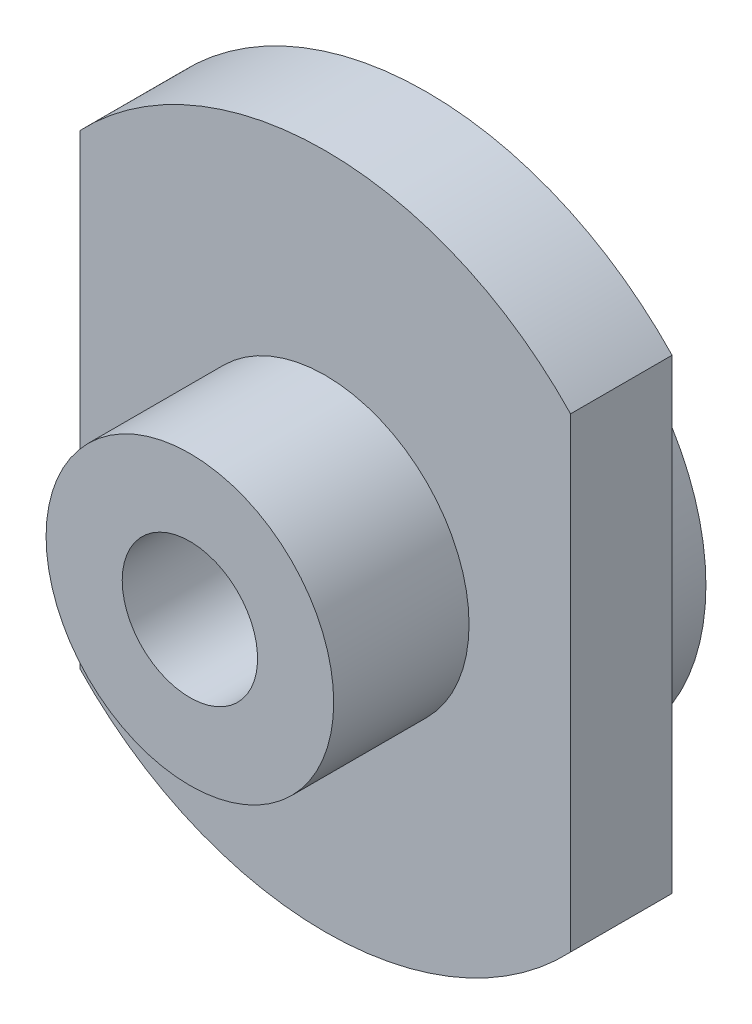
ISO-10303-21;
HEADER;
FILE_DESCRIPTION(('STEP AP214'),'2;1');
FILE_NAME('part.step','',(''),(''),'','','');
FILE_SCHEMA(('AUTOMOTIVE_DESIGN { 1 0 10303 214 1 1 1 1 }'));
ENDSEC;
DATA;
#1=APPLICATION_CONTEXT('core data for automotive mechanical design processes');
#2=APPLICATION_PROTOCOL_DEFINITION('international standard','automotive_design',2000,#1);
#3=PRODUCT_CONTEXT('',#1,'mechanical');
#4=PRODUCT('Part','Part','',(#3));
#5=PRODUCT_RELATED_PRODUCT_CATEGORY('part','',(#4));
#6=PRODUCT_DEFINITION_FORMATION('','',#4);
#7=PRODUCT_DEFINITION_CONTEXT('part definition',#1,'design');
#8=PRODUCT_DEFINITION('design','',#6,#7);
#9=PRODUCT_DEFINITION_SHAPE('','',#8);
#10=(LENGTH_UNIT() NAMED_UNIT(*) SI_UNIT(.MILLI.,.METRE.));
#11=(NAMED_UNIT(*) PLANE_ANGLE_UNIT() SI_UNIT($,.RADIAN.));
#12=(NAMED_UNIT(*) SI_UNIT($,.STERADIAN.) SOLID_ANGLE_UNIT());
#13=UNCERTAINTY_MEASURE_WITH_UNIT(LENGTH_MEASURE(1.E-05),#10,'distance_accuracy_value','');
#14=(GEOMETRIC_REPRESENTATION_CONTEXT(3) GLOBAL_UNCERTAINTY_ASSIGNED_CONTEXT((#13)) GLOBAL_UNIT_ASSIGNED_CONTEXT((#10,
#11,#12)) REPRESENTATION_CONTEXT('',''));
#15=CARTESIAN_POINT('',(0.,0.,0.));
#16=DIRECTION('',(0.,0.,1.));
#17=DIRECTION('',(1.,0.,0.));
#18=AXIS2_PLACEMENT_3D('',#15,#16,#17);
#19=CARTESIAN_POINT('',(0.,0.,149.137084989848));
#20=DIRECTION('',(0.,0.,-1.));
#21=DIRECTION('',(-1.,0.,0.));
#22=AXIS2_PLACEMENT_3D('',#19,#20,#21);
#23=CYLINDRICAL_SURFACE('',#22,40.);
#24=DIRECTION('',(0.,0.,-1.));
#25=VECTOR('',#24,1.);
#26=CARTESIAN_POINT('',(29.,-27.5499546279118,149.137084989848));
#27=LINE('',#26,#25);
#28=CARTESIAN_POINT('',(29.,-27.5499546279118,18.));
#29=VERTEX_POINT('',#28);
#30=CARTESIAN_POINT('',(29.,-27.5499546279118,6.00000000000001));
#31=VERTEX_POINT('',#30);
#32=EDGE_CURVE('E87',#29,#31,#27,.T.);
#33=ORIENTED_EDGE('',*,*,#32,.F.);
#34=CARTESIAN_POINT('',(0.,0.,18.));
#35=DIRECTION('',(0.,0.,1.));
#36=DIRECTION('',(1.,0.,0.));
#37=AXIS2_PLACEMENT_3D('',#34,#35,#36);
#38=CIRCLE('',#37,40.);
#39=CARTESIAN_POINT('',(-29.,-27.5499546279118,18.));
#40=VERTEX_POINT('',#39);
#41=EDGE_CURVE('E77',#40,#29,#38,.T.);
#42=ORIENTED_EDGE('',*,*,#41,.F.);
#43=DIRECTION('',(0.,0.,-1.));
#44=VECTOR('',#43,1.);
#45=CARTESIAN_POINT('',(-29.,-27.5499546279118,149.137084989848));
#46=LINE('',#45,#44);
#47=CARTESIAN_POINT('',(-29.,-27.5499546279118,6.00000000000001));
#48=VERTEX_POINT('',#47);
#49=EDGE_CURVE('E51',#48,#40,#46,.F.);
#50=ORIENTED_EDGE('',*,*,#49,.F.);
#51=CARTESIAN_POINT('',(0.,0.,6.));
#52=DIRECTION('',(0.,0.,1.));
#53=DIRECTION('',(1.,0.,0.));
#54=AXIS2_PLACEMENT_3D('',#51,#52,#53);
#55=CIRCLE('',#54,40.);
#56=EDGE_CURVE('E91',#48,#31,#55,.T.);
#57=ORIENTED_EDGE('',*,*,#56,.T.);
#58=EDGE_LOOP('',(#33,#42,#50,#57));
#59=FACE_BOUND('',#58,.T.);
#60=ADVANCED_FACE('F36',(#59),#23,.T.);
#61=DIRECTION('',(0.,0.,-1.));
#62=VECTOR('',#61,1.);
#63=CARTESIAN_POINT('',(29.,27.5499546279118,149.137084989848));
#64=LINE('',#63,#62);
#65=CARTESIAN_POINT('',(29.,27.5499546279118,6.00000000000001));
#66=VERTEX_POINT('',#65);
#67=CARTESIAN_POINT('',(29.,27.5499546279118,18.));
#68=VERTEX_POINT('',#67);
#69=EDGE_CURVE('E58',#66,#68,#64,.F.);
#70=ORIENTED_EDGE('',*,*,#69,.F.);
#71=CARTESIAN_POINT('',(-29.,27.5499546279118,6.00000000000001));
#72=VERTEX_POINT('',#71);
#73=EDGE_CURVE('E83',#66,#72,#55,.T.);
#74=ORIENTED_EDGE('',*,*,#73,.T.);
#75=DIRECTION('',(0.,0.,-1.));
#76=VECTOR('',#75,1.);
#77=CARTESIAN_POINT('',(-29.,27.5499546279118,149.137084989848));
#78=LINE('',#77,#76);
#79=CARTESIAN_POINT('',(-29.,27.5499546279118,18.));
#80=VERTEX_POINT('',#79);
#81=EDGE_CURVE('E100',#80,#72,#78,.T.);
#82=ORIENTED_EDGE('',*,*,#81,.F.);
#83=EDGE_CURVE('E82',#68,#80,#38,.T.);
#84=ORIENTED_EDGE('',*,*,#83,.F.);
#85=EDGE_LOOP('',(#70,#74,#82,#84));
#86=FACE_BOUND('',#85,.T.);
#87=ADVANCED_FACE('F135',(#86),#23,.T.);
#88=CARTESIAN_POINT('',(0.,0.,6.));
#89=DIRECTION('',(0.,0.,1.));
#90=DIRECTION('',(1.,0.,0.));
#91=AXIS2_PLACEMENT_3D('',#88,#89,#90);
#92=PLANE('',#91);
#93=CARTESIAN_POINT('',(0.,0.,6.00000000000001));
#94=DIRECTION('',(0.,0.,1.));
#95=DIRECTION('',(1.,0.,0.));
#96=AXIS2_PLACEMENT_3D('',#93,#94,#95);
#97=CIRCLE('',#96,27.);
#98=CARTESIAN_POINT('',(27.,0.,6.00000000000001));
#99=VERTEX_POINT('',#98);
#100=EDGE_CURVE('E89',#99,#99,#97,.F.);
#101=ORIENTED_EDGE('',*,*,#100,.F.);
#102=EDGE_LOOP('',(#101));
#103=FACE_BOUND('',#102,.T.);
#104=DIRECTION('',(0.,-1.,0.));
#105=VECTOR('',#104,1.);
#106=CARTESIAN_POINT('',(-29.,0.,6.));
#107=LINE('',#106,#105);
#108=EDGE_CURVE('E103',#72,#48,#107,.T.);
#109=ORIENTED_EDGE('',*,*,#108,.F.);
#110=ORIENTED_EDGE('',*,*,#73,.F.);
#111=DIRECTION('',(0.,1.,0.));
#112=VECTOR('',#111,1.);
#113=CARTESIAN_POINT('',(29.,0.,6.));
#114=LINE('',#113,#112);
#115=EDGE_CURVE('E92',#31,#66,#114,.T.);
#116=ORIENTED_EDGE('',*,*,#115,.F.);
#117=ORIENTED_EDGE('',*,*,#56,.F.);
#118=EDGE_LOOP('',(#109,#110,#116,#117));
#119=FACE_BOUND('',#118,.T.);
#120=ADVANCED_FACE('F132',(#103,#119),#92,.F.);
#121=CARTESIAN_POINT('',(0.,0.,18.));
#122=DIRECTION('',(0.,0.,1.));
#123=DIRECTION('',(1.,0.,0.));
#124=AXIS2_PLACEMENT_3D('',#121,#122,#123);
#125=PLANE('',#124);
#126=CARTESIAN_POINT('',(0.,0.,18.));
#127=DIRECTION('',(0.,0.,1.));
#128=DIRECTION('',(1.,0.,0.));
#129=AXIS2_PLACEMENT_3D('',#126,#127,#128);
#130=CIRCLE('',#129,17.);
#131=CARTESIAN_POINT('',(17.,0.,18.));
#132=VERTEX_POINT('',#131);
#133=EDGE_CURVE('E121',#132,#132,#130,.T.);
#134=ORIENTED_EDGE('',*,*,#133,.F.);
#135=EDGE_LOOP('',(#134));
#136=FACE_BOUND('',#135,.T.);
#137=ORIENTED_EDGE('',*,*,#83,.T.);
#138=DIRECTION('',(0.,-1.,0.));
#139=VECTOR('',#138,1.);
#140=CARTESIAN_POINT('',(-29.,0.,18.));
#141=LINE('',#140,#139);
#142=EDGE_CURVE('E13',#80,#40,#141,.T.);
#143=ORIENTED_EDGE('',*,*,#142,.T.);
#144=ORIENTED_EDGE('',*,*,#41,.T.);
#145=DIRECTION('',(0.,1.,0.));
#146=VECTOR('',#145,1.);
#147=CARTESIAN_POINT('',(29.,0.,18.));
#148=LINE('',#147,#146);
#149=EDGE_CURVE('E44',#29,#68,#148,.T.);
#150=ORIENTED_EDGE('',*,*,#149,.T.);
#151=EDGE_LOOP('',(#137,#143,#144,#150));
#152=FACE_BOUND('',#151,.T.);
#153=ADVANCED_FACE('F78',(#136,#152),#125,.T.);
#154=CARTESIAN_POINT('',(0.,0.,34.));
#155=DIRECTION('',(0.,0.,1.));
#156=DIRECTION('',(1.,0.,0.));
#157=AXIS2_PLACEMENT_3D('',#154,#155,#156);
#158=PLANE('',#157);
#159=CARTESIAN_POINT('',(0.,0.,34.));
#160=DIRECTION('',(0.,0.,-1.));
#161=DIRECTION('',(-1.,0.,0.));
#162=AXIS2_PLACEMENT_3D('',#159,#160,#161);
#163=CIRCLE('',#162,8.);
#164=CARTESIAN_POINT('',(-8.,0.,34.));
#165=VERTEX_POINT('',#164);
#166=EDGE_CURVE('E95',#165,#165,#163,.T.);
#167=ORIENTED_EDGE('',*,*,#166,.T.);
#168=EDGE_LOOP('',(#167));
#169=FACE_BOUND('',#168,.T.);
#170=CARTESIAN_POINT('',(0.,0.,34.));
#171=DIRECTION('',(0.,0.,1.));
#172=DIRECTION('',(1.,0.,0.));
#173=AXIS2_PLACEMENT_3D('',#170,#171,#172);
#174=CIRCLE('',#173,17.);
#175=CARTESIAN_POINT('',(17.,0.,34.));
#176=VERTEX_POINT('',#175);
#177=EDGE_CURVE('E122',#176,#176,#174,.T.);
#178=ORIENTED_EDGE('',*,*,#177,.T.);
#179=EDGE_LOOP('',(#178));
#180=FACE_BOUND('',#179,.T.);
#181=ADVANCED_FACE('F151',(#169,#180),#158,.T.);
#182=CARTESIAN_POINT('',(0.,0.,34.));
#183=DIRECTION('',(0.,0.,-1.));
#184=DIRECTION('',(-1.,0.,0.));
#185=AXIS2_PLACEMENT_3D('',#182,#183,#184);
#186=CYLINDRICAL_SURFACE('',#185,17.);
#187=ORIENTED_EDGE('',*,*,#133,.T.);
#188=EDGE_LOOP('',(#187));
#189=FACE_BOUND('',#188,.T.);
#190=ORIENTED_EDGE('',*,*,#177,.F.);
#191=EDGE_LOOP('',(#190));
#192=FACE_BOUND('',#191,.T.);
#193=ADVANCED_FACE('F38',(#189,#192),#186,.T.);
#194=CARTESIAN_POINT('',(0.,0.,-76.3675323681471));
#195=DIRECTION('',(0.,0.,1.));
#196=DIRECTION('',(1.,0.,0.));
#197=AXIS2_PLACEMENT_3D('',#194,#195,#196);
#198=CYLINDRICAL_SURFACE('',#197,27.);
#199=CARTESIAN_POINT('',(0.,0.,0.));
#200=DIRECTION('',(0.,0.,1.));
#201=DIRECTION('',(1.,0.,0.));
#202=AXIS2_PLACEMENT_3D('',#199,#200,#201);
#203=CIRCLE('',#202,27.);
#204=CARTESIAN_POINT('',(27.,0.,0.));
#205=VERTEX_POINT('',#204);
#206=EDGE_CURVE('E115',#205,#205,#203,.T.);
#207=ORIENTED_EDGE('',*,*,#206,.T.);
#208=EDGE_LOOP('',(#207));
#209=FACE_BOUND('',#208,.T.);
#210=ORIENTED_EDGE('',*,*,#100,.T.);
#211=EDGE_LOOP('',(#210));
#212=FACE_BOUND('',#211,.T.);
#213=ADVANCED_FACE('F130',(#209,#212),#198,.T.);
#214=CARTESIAN_POINT('',(0.,0.,0.));
#215=DIRECTION('',(0.,0.,1.));
#216=DIRECTION('',(1.,0.,0.));
#217=AXIS2_PLACEMENT_3D('',#214,#215,#216);
#218=PLANE('',#217);
#219=CARTESIAN_POINT('',(0.,0.,0.));
#220=DIRECTION('',(0.,0.,-1.));
#221=DIRECTION('',(-1.,0.,0.));
#222=AXIS2_PLACEMENT_3D('',#219,#220,#221);
#223=CIRCLE('',#222,24.);
#224=CARTESIAN_POINT('',(-24.,0.,0.));
#225=VERTEX_POINT('',#224);
#226=EDGE_CURVE('E109',#225,#225,#223,.T.);
#227=ORIENTED_EDGE('',*,*,#226,.F.);
#228=EDGE_LOOP('',(#227));
#229=FACE_BOUND('',#228,.T.);
#230=ORIENTED_EDGE('',*,*,#206,.F.);
#231=EDGE_LOOP('',(#230));
#232=FACE_BOUND('',#231,.T.);
#233=ADVANCED_FACE('F155',(#229,#232),#218,.F.);
#234=CARTESIAN_POINT('',(0.,0.,9.));
#235=DIRECTION('',(0.,0.,-1.));
#236=DIRECTION('',(-1.,0.,0.));
#237=AXIS2_PLACEMENT_3D('',#234,#235,#236);
#238=CYLINDRICAL_SURFACE('',#237,24.);
#239=CARTESIAN_POINT('',(0.,0.,9.));
#240=DIRECTION('',(0.,0.,-1.));
#241=DIRECTION('',(-1.,0.,0.));
#242=AXIS2_PLACEMENT_3D('',#239,#240,#241);
#243=CIRCLE('',#242,24.);
#244=CARTESIAN_POINT('',(-24.,0.,9.));
#245=VERTEX_POINT('',#244);
#246=EDGE_CURVE('E112',#245,#245,#243,.T.);
#247=ORIENTED_EDGE('',*,*,#246,.F.);
#248=EDGE_LOOP('',(#247));
#249=FACE_BOUND('',#248,.T.);
#250=ORIENTED_EDGE('',*,*,#226,.T.);
#251=EDGE_LOOP('',(#250));
#252=FACE_BOUND('',#251,.T.);
#253=ADVANCED_FACE('F157',(#249,#252),#238,.F.);
#254=CARTESIAN_POINT('',(0.,0.,9.));
#255=DIRECTION('',(0.,0.,-1.));
#256=DIRECTION('',(-1.,0.,0.));
#257=AXIS2_PLACEMENT_3D('',#254,#255,#256);
#258=PLANE('',#257);
#259=CARTESIAN_POINT('',(0.,0.,9.));
#260=DIRECTION('',(0.,0.,-1.));
#261=DIRECTION('',(-1.,0.,0.));
#262=AXIS2_PLACEMENT_3D('',#259,#260,#261);
#263=CIRCLE('',#262,12.);
#264=CARTESIAN_POINT('',(-12.,0.,9.));
#265=VERTEX_POINT('',#264);
#266=EDGE_CURVE('E106',#265,#265,#263,.T.);
#267=ORIENTED_EDGE('',*,*,#266,.F.);
#268=EDGE_LOOP('',(#267));
#269=FACE_BOUND('',#268,.T.);
#270=ORIENTED_EDGE('',*,*,#246,.T.);
#271=EDGE_LOOP('',(#270));
#272=FACE_BOUND('',#271,.T.);
#273=ADVANCED_FACE('F164',(#269,#272),#258,.T.);
#274=CARTESIAN_POINT('',(0.,0.,9.));
#275=DIRECTION('',(0.,0.,-1.));
#276=DIRECTION('',(-1.,0.,0.));
#277=AXIS2_PLACEMENT_3D('',#274,#275,#276);
#278=CYLINDRICAL_SURFACE('',#277,12.);
#279=ORIENTED_EDGE('',*,*,#266,.T.);
#280=EDGE_LOOP('',(#279));
#281=FACE_BOUND('',#280,.T.);
#282=CARTESIAN_POINT('',(0.,0.,0.));
#283=DIRECTION('',(0.,0.,-1.));
#284=DIRECTION('',(-1.,0.,0.));
#285=AXIS2_PLACEMENT_3D('',#282,#283,#284);
#286=CIRCLE('',#285,12.);
#287=CARTESIAN_POINT('',(-12.,0.,0.));
#288=VERTEX_POINT('',#287);
#289=EDGE_CURVE('E105',#288,#288,#286,.T.);
#290=ORIENTED_EDGE('',*,*,#289,.F.);
#291=EDGE_LOOP('',(#290));
#292=FACE_BOUND('',#291,.T.);
#293=ADVANCED_FACE('F172',(#281,#292),#278,.T.);
#294=CARTESIAN_POINT('',(0.,0.,0.));
#295=DIRECTION('',(0.,0.,-1.));
#296=DIRECTION('',(-1.,0.,0.));
#297=AXIS2_PLACEMENT_3D('',#294,#295,#296);
#298=CIRCLE('',#297,8.);
#299=CARTESIAN_POINT('',(-8.,0.,0.));
#300=VERTEX_POINT('',#299);
#301=EDGE_CURVE('E185',#300,#300,#298,.T.);
#302=ORIENTED_EDGE('',*,*,#301,.F.);
#303=EDGE_LOOP('',(#302));
#304=FACE_BOUND('',#303,.T.);
#305=ORIENTED_EDGE('',*,*,#289,.T.);
#306=EDGE_LOOP('',(#305));
#307=FACE_BOUND('',#306,.T.);
#308=ADVANCED_FACE('F159',(#304,#307),#218,.F.);
#309=CARTESIAN_POINT('',(0.,0.,34.));
#310=DIRECTION('',(0.,0.,-1.));
#311=DIRECTION('',(-1.,0.,0.));
#312=AXIS2_PLACEMENT_3D('',#309,#310,#311);
#313=CYLINDRICAL_SURFACE('',#312,8.);
#314=ORIENTED_EDGE('',*,*,#166,.F.);
#315=EDGE_LOOP('',(#314));
#316=FACE_BOUND('',#315,.T.);
#317=ORIENTED_EDGE('',*,*,#301,.T.);
#318=EDGE_LOOP('',(#317));
#319=FACE_BOUND('',#318,.T.);
#320=ADVANCED_FACE('F171',(#316,#319),#313,.F.);
#321=CARTESIAN_POINT('',(29.,-40.,34.));
#322=DIRECTION('',(1.,0.,0.));
#323=DIRECTION('',(0.,0.,-1.));
#324=AXIS2_PLACEMENT_3D('',#321,#322,#323);
#325=PLANE('',#324);
#326=ORIENTED_EDGE('',*,*,#115,.T.);
#327=ORIENTED_EDGE('',*,*,#69,.T.);
#328=ORIENTED_EDGE('',*,*,#149,.F.);
#329=ORIENTED_EDGE('',*,*,#32,.T.);
#330=EDGE_LOOP('',(#326,#327,#328,#329));
#331=FACE_BOUND('',#330,.T.);
#332=ADVANCED_FACE('F86',(#331),#325,.T.);
#333=CARTESIAN_POINT('',(-29.,-40.,34.));
#334=DIRECTION('',(-1.,0.,0.));
#335=DIRECTION('',(0.,0.,1.));
#336=AXIS2_PLACEMENT_3D('',#333,#334,#335);
#337=PLANE('',#336);
#338=ORIENTED_EDGE('',*,*,#108,.T.);
#339=ORIENTED_EDGE('',*,*,#49,.T.);
#340=ORIENTED_EDGE('',*,*,#142,.F.);
#341=ORIENTED_EDGE('',*,*,#81,.T.);
#342=EDGE_LOOP('',(#338,#339,#340,#341));
#343=FACE_BOUND('',#342,.T.);
#344=ADVANCED_FACE('F139',(#343),#337,.T.);
#345=CLOSED_SHELL('',(#60,#87,#120,#153,#181,#193,#213,#233,#253,#273,#293,#308,#320,#332,#344));
#346=MANIFOLD_SOLID_BREP('B2',#345);
#347=ADVANCED_BREP_SHAPE_REPRESENTATION('',(#18,#346),#14);
#348=SHAPE_DEFINITION_REPRESENTATION(#9,#347);
ENDSEC;
END-ISO-10303-21;
